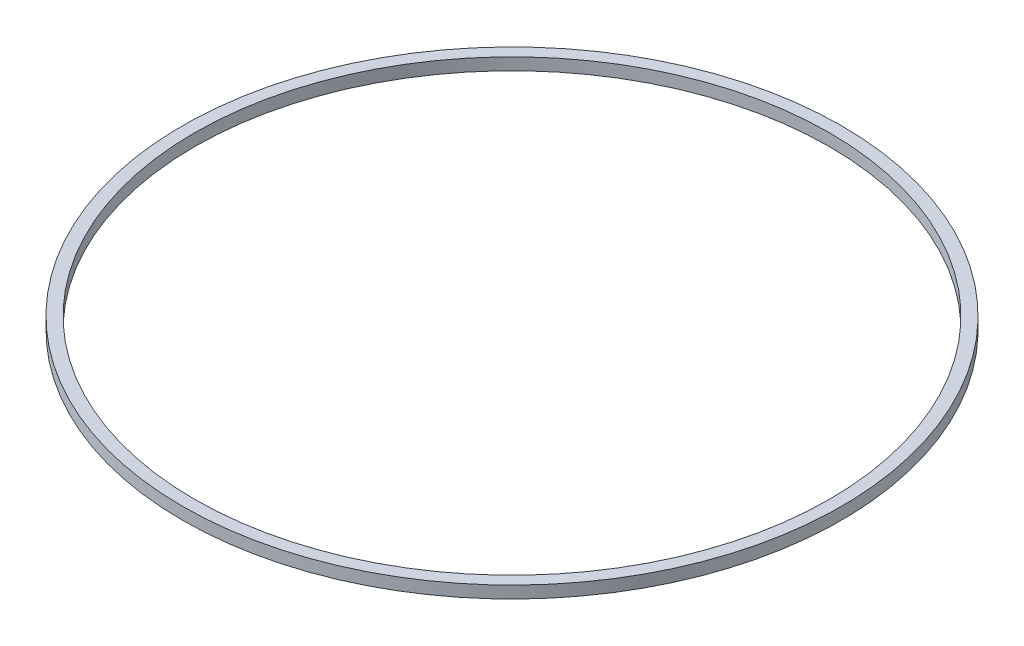
ISO-10303-21;
HEADER;
FILE_DESCRIPTION(('STEP AP214'),'2;1');
FILE_NAME('part.step','',(''),(''),'','','');
FILE_SCHEMA(('AUTOMOTIVE_DESIGN { 1 0 10303 214 1 1 1 1 }'));
ENDSEC;
DATA;
#1=APPLICATION_CONTEXT('core data for automotive mechanical design processes');
#2=APPLICATION_PROTOCOL_DEFINITION('international standard','automotive_design',2000,#1);
#3=PRODUCT_CONTEXT('',#1,'mechanical');
#4=PRODUCT('Part','Part','',(#3));
#5=PRODUCT_RELATED_PRODUCT_CATEGORY('part','',(#4));
#6=PRODUCT_DEFINITION_FORMATION('','',#4);
#7=PRODUCT_DEFINITION_CONTEXT('part definition',#1,'design');
#8=PRODUCT_DEFINITION('design','',#6,#7);
#9=PRODUCT_DEFINITION_SHAPE('','',#8);
#10=(LENGTH_UNIT() NAMED_UNIT(*) SI_UNIT(.MILLI.,.METRE.));
#11=(NAMED_UNIT(*) PLANE_ANGLE_UNIT() SI_UNIT($,.RADIAN.));
#12=(NAMED_UNIT(*) SI_UNIT($,.STERADIAN.) SOLID_ANGLE_UNIT());
#13=UNCERTAINTY_MEASURE_WITH_UNIT(LENGTH_MEASURE(1.E-05),#10,'distance_accuracy_value','');
#14=(GEOMETRIC_REPRESENTATION_CONTEXT(3) GLOBAL_UNCERTAINTY_ASSIGNED_CONTEXT((#13)) GLOBAL_UNIT_ASSIGNED_CONTEXT((#10,
#11,#12)) REPRESENTATION_CONTEXT('',''));
#15=CARTESIAN_POINT('',(0.,0.,0.));
#16=DIRECTION('',(0.,0.,1.));
#17=DIRECTION('',(1.,0.,0.));
#18=AXIS2_PLACEMENT_3D('',#15,#16,#17);
#19=CARTESIAN_POINT('',(0.,0.,0.));
#20=DIRECTION('',(0.,-1.,0.));
#21=DIRECTION('',(0.,0.,-1.));
#22=AXIS2_PLACEMENT_3D('',#19,#20,#21);
#23=CYLINDRICAL_SURFACE('',#22,2076.2);
#24=CARTESIAN_POINT('',(0.,38.0999999999997,0.));
#25=DIRECTION('',(0.,-1.,0.));
#26=DIRECTION('',(0.,0.,-1.));
#27=AXIS2_PLACEMENT_3D('',#24,#25,#26);
#28=CIRCLE('',#27,2076.2);
#29=CARTESIAN_POINT('',(0.,38.0999999999997,-2076.2));
#30=VERTEX_POINT('',#29);
#31=EDGE_CURVE('E10',#30,#30,#28,.T.);
#32=ORIENTED_EDGE('',*,*,#31,.T.);
#33=EDGE_LOOP('',(#32));
#34=FACE_BOUND('',#33,.T.);
#35=CARTESIAN_POINT('',(0.,-38.0999999999997,0.));
#36=DIRECTION('',(0.,-1.,0.));
#37=DIRECTION('',(0.,0.,-1.));
#38=AXIS2_PLACEMENT_3D('',#35,#36,#37);
#39=CIRCLE('',#38,2076.2);
#40=CARTESIAN_POINT('',(0.,-38.0999999999997,-2076.2));
#41=VERTEX_POINT('',#40);
#42=EDGE_CURVE('E49',#41,#41,#39,.T.);
#43=ORIENTED_EDGE('',*,*,#42,.F.);
#44=EDGE_LOOP('',(#43));
#45=FACE_BOUND('',#44,.T.);
#46=ADVANCED_FACE('F35',(#34,#45),#23,.T.);
#47=CARTESIAN_POINT('',(2000.,38.0999999999999,0.));
#48=DIRECTION('',(0.,1.,0.));
#49=DIRECTION('',(0.,0.,1.));
#50=AXIS2_PLACEMENT_3D('',#47,#48,#49);
#51=PLANE('',#50);
#52=CARTESIAN_POINT('',(0.,38.1,0.));
#53=DIRECTION('',(0.,-1.,0.));
#54=DIRECTION('',(0.,0.,-1.));
#55=AXIS2_PLACEMENT_3D('',#52,#53,#54);
#56=CIRCLE('',#55,2000.);
#57=CARTESIAN_POINT('',(0.,38.1,-2000.));
#58=VERTEX_POINT('',#57);
#59=EDGE_CURVE('E41',#58,#58,#56,.T.);
#60=ORIENTED_EDGE('',*,*,#59,.T.);
#61=EDGE_LOOP('',(#60));
#62=FACE_BOUND('',#61,.T.);
#63=ORIENTED_EDGE('',*,*,#31,.F.);
#64=EDGE_LOOP('',(#63));
#65=FACE_BOUND('',#64,.T.);
#66=ADVANCED_FACE('F59',(#62,#65),#51,.T.);
#67=CARTESIAN_POINT('',(0.,0.,0.));
#68=DIRECTION('',(0.,-1.,0.));
#69=DIRECTION('',(0.,0.,-1.));
#70=AXIS2_PLACEMENT_3D('',#67,#68,#69);
#71=CYLINDRICAL_SURFACE('',#70,2000.);
#72=CARTESIAN_POINT('',(0.,-38.1,0.));
#73=DIRECTION('',(0.,-1.,0.));
#74=DIRECTION('',(0.,0.,-1.));
#75=AXIS2_PLACEMENT_3D('',#72,#73,#74);
#76=CIRCLE('',#75,2000.);
#77=CARTESIAN_POINT('',(0.,-38.1,-2000.));
#78=VERTEX_POINT('',#77);
#79=EDGE_CURVE('E45',#78,#78,#76,.T.);
#80=ORIENTED_EDGE('',*,*,#79,.T.);
#81=EDGE_LOOP('',(#80));
#82=FACE_BOUND('',#81,.T.);
#83=ORIENTED_EDGE('',*,*,#59,.F.);
#84=EDGE_LOOP('',(#83));
#85=FACE_BOUND('',#84,.T.);
#86=ADVANCED_FACE('F63',(#82,#85),#71,.F.);
#87=CARTESIAN_POINT('',(2000.,-38.0999999999998,0.));
#88=DIRECTION('',(0.,-1.,0.));
#89=DIRECTION('',(0.,0.,-1.));
#90=AXIS2_PLACEMENT_3D('',#87,#88,#89);
#91=PLANE('',#90);
#92=ORIENTED_EDGE('',*,*,#42,.T.);
#93=EDGE_LOOP('',(#92));
#94=FACE_BOUND('',#93,.T.);
#95=ORIENTED_EDGE('',*,*,#79,.F.);
#96=EDGE_LOOP('',(#95));
#97=FACE_BOUND('',#96,.T.);
#98=ADVANCED_FACE('F55',(#94,#97),#91,.T.);
#99=CLOSED_SHELL('',(#46,#66,#86,#98));
#100=MANIFOLD_SOLID_BREP('B2',#99);
#101=ADVANCED_BREP_SHAPE_REPRESENTATION('',(#18,#100),#14);
#102=SHAPE_DEFINITION_REPRESENTATION(#9,#101);
ENDSEC;
END-ISO-10303-21;
